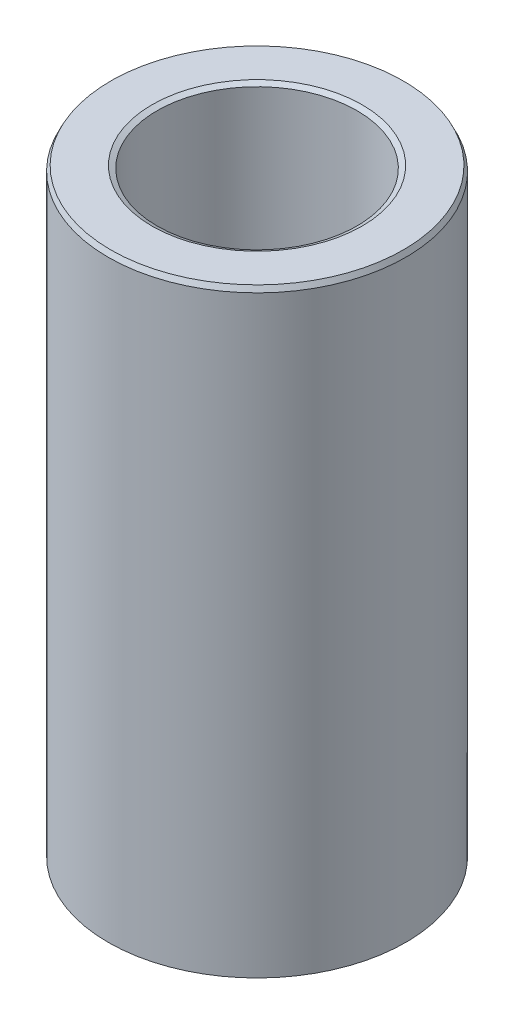
ISO-10303-21;
HEADER;
FILE_DESCRIPTION(('STEP AP214'),'2;1');
FILE_NAME('part.step','',(''),(''),'','','');
FILE_SCHEMA(('AUTOMOTIVE_DESIGN { 1 0 10303 214 1 1 1 1 }'));
ENDSEC;
DATA;
#1=APPLICATION_CONTEXT('core data for automotive mechanical design processes');
#2=APPLICATION_PROTOCOL_DEFINITION('international standard','automotive_design',2000,#1);
#3=PRODUCT_CONTEXT('',#1,'mechanical');
#4=PRODUCT('Part','Part','',(#3));
#5=PRODUCT_RELATED_PRODUCT_CATEGORY('part','',(#4));
#6=PRODUCT_DEFINITION_FORMATION('','',#4);
#7=PRODUCT_DEFINITION_CONTEXT('part definition',#1,'design');
#8=PRODUCT_DEFINITION('design','',#6,#7);
#9=PRODUCT_DEFINITION_SHAPE('','',#8);
#10=(LENGTH_UNIT() NAMED_UNIT(*) SI_UNIT(.MILLI.,.METRE.));
#11=(NAMED_UNIT(*) PLANE_ANGLE_UNIT() SI_UNIT($,.RADIAN.));
#12=(NAMED_UNIT(*) SI_UNIT($,.STERADIAN.) SOLID_ANGLE_UNIT());
#13=UNCERTAINTY_MEASURE_WITH_UNIT(LENGTH_MEASURE(1.E-05),#10,'distance_accuracy_value','');
#14=(GEOMETRIC_REPRESENTATION_CONTEXT(3) GLOBAL_UNCERTAINTY_ASSIGNED_CONTEXT((#13)) GLOBAL_UNIT_ASSIGNED_CONTEXT((#10,
#11,#12)) REPRESENTATION_CONTEXT('',''));
#15=CARTESIAN_POINT('',(0.,0.,0.));
#16=DIRECTION('',(0.,0.,1.));
#17=DIRECTION('',(1.,0.,0.));
#18=AXIS2_PLACEMENT_3D('',#15,#16,#17);
#19=CARTESIAN_POINT('',(0.,201.895542038575,0.));
#20=DIRECTION('',(0.,-1.,0.));
#21=DIRECTION('',(0.,0.,-1.));
#22=AXIS2_PLACEMENT_3D('',#19,#20,#21);
#23=CYLINDRICAL_SURFACE('',#22,50.);
#24=CARTESIAN_POINT('',(0.,0.842176969868269,0.));
#25=DIRECTION('',(0.,1.,0.));
#26=DIRECTION('',(0.,0.,1.));
#27=AXIS2_PLACEMENT_3D('',#24,#25,#26);
#28=CIRCLE('',#27,50.);
#29=CARTESIAN_POINT('',(0.,0.842176969868269,50.));
#30=VERTEX_POINT('',#29);
#31=EDGE_CURVE('E10',#30,#30,#28,.T.);
#32=ORIENTED_EDGE('',*,*,#31,.T.);
#33=EDGE_LOOP('',(#32));
#34=FACE_BOUND('',#33,.T.);
#35=CARTESIAN_POINT('',(0.,200.164972738618,0.));
#36=DIRECTION('',(0.,1.,0.));
#37=DIRECTION('',(0.,0.,1.));
#38=AXIS2_PLACEMENT_3D('',#35,#36,#37);
#39=CIRCLE('',#38,50.);
#40=CARTESIAN_POINT('',(0.,200.164972738618,50.));
#41=VERTEX_POINT('',#40);
#42=EDGE_CURVE('E50',#41,#41,#39,.F.);
#43=ORIENTED_EDGE('',*,*,#42,.T.);
#44=EDGE_LOOP('',(#43));
#45=FACE_BOUND('',#44,.T.);
#46=ADVANCED_FACE('F39',(#34,#45),#23,.T.);
#47=CARTESIAN_POINT('',(0.,201.895542038575,0.));
#48=DIRECTION('',(0.,1.,0.));
#49=DIRECTION('',(0.,0.,1.));
#50=AXIS2_PLACEMENT_3D('',#47,#48,#49);
#51=PLANE('',#50);
#52=CARTESIAN_POINT('',(0.,201.895542038575,0.));
#53=DIRECTION('',(0.,1.,0.));
#54=DIRECTION('',(0.,0.,1.));
#55=AXIS2_PLACEMENT_3D('',#52,#53,#54);
#56=CIRCLE('',#55,35.3079660368954);
#57=CARTESIAN_POINT('',(0.,201.895542038575,35.3079660368954));
#58=VERTEX_POINT('',#57);
#59=EDGE_CURVE('E58',#58,#58,#56,.F.);
#60=ORIENTED_EDGE('',*,*,#59,.T.);
#61=EDGE_LOOP('',(#60));
#62=FACE_BOUND('',#61,.T.);
#63=CARTESIAN_POINT('',(0.,201.895542038575,0.));
#64=DIRECTION('',(0.,1.,0.));
#65=DIRECTION('',(0.,0.,1.));
#66=AXIS2_PLACEMENT_3D('',#63,#64,#65);
#67=CIRCLE('',#66,49.1578230301318);
#68=CARTESIAN_POINT('',(0.,201.895542038575,49.1578230301318));
#69=VERTEX_POINT('',#68);
#70=EDGE_CURVE('E61',#69,#69,#67,.T.);
#71=ORIENTED_EDGE('',*,*,#70,.T.);
#72=EDGE_LOOP('',(#71));
#73=FACE_BOUND('',#72,.T.);
#74=ADVANCED_FACE('F88',(#62,#73),#51,.T.);
#75=CARTESIAN_POINT('',(0.,0.,0.));
#76=DIRECTION('',(0.,1.,0.));
#77=DIRECTION('',(0.,0.,1.));
#78=AXIS2_PLACEMENT_3D('',#75,#76,#77);
#79=PLANE('',#78);
#80=CARTESIAN_POINT('',(0.,0.,0.));
#81=DIRECTION('',(0.,1.,0.));
#82=DIRECTION('',(0.,0.,1.));
#83=AXIS2_PLACEMENT_3D('',#80,#81,#82);
#84=CIRCLE('',#83,34.4195737068063);
#85=CARTESIAN_POINT('',(0.,0.,34.4195737068063));
#86=VERTEX_POINT('',#85);
#87=EDGE_CURVE('E51',#86,#86,#84,.T.);
#88=ORIENTED_EDGE('',*,*,#87,.T.);
#89=EDGE_LOOP('',(#88));
#90=FACE_BOUND('',#89,.T.);
#91=CARTESIAN_POINT('',(0.,0.,0.));
#92=DIRECTION('',(0.,1.,0.));
#93=DIRECTION('',(0.,0.,1.));
#94=AXIS2_PLACEMENT_3D('',#91,#92,#93);
#95=CIRCLE('',#94,48.2694307000426);
#96=CARTESIAN_POINT('',(0.,0.,48.2694307000426));
#97=VERTEX_POINT('',#96);
#98=EDGE_CURVE('E54',#97,#97,#95,.F.);
#99=ORIENTED_EDGE('',*,*,#98,.T.);
#100=EDGE_LOOP('',(#99));
#101=FACE_BOUND('',#100,.T.);
#102=ADVANCED_FACE('F83',(#90,#101),#79,.F.);
#103=CARTESIAN_POINT('',(0.,201.895542038575,0.));
#104=DIRECTION('',(0.,-1.,0.));
#105=DIRECTION('',(0.,0.,-1.));
#106=AXIS2_PLACEMENT_3D('',#103,#104,#105);
#107=CYLINDRICAL_SURFACE('',#106,33.577396736938);
#108=CARTESIAN_POINT('',(0.,201.053365068707,0.));
#109=DIRECTION('',(0.,1.,0.));
#110=DIRECTION('',(0.,0.,1.));
#111=AXIS2_PLACEMENT_3D('',#108,#109,#110);
#112=CIRCLE('',#111,33.577396736938);
#113=CARTESIAN_POINT('',(0.,201.053365068707,33.5773967369379));
#114=VERTEX_POINT('',#113);
#115=EDGE_CURVE('E67',#114,#114,#112,.T.);
#116=ORIENTED_EDGE('',*,*,#115,.T.);
#117=EDGE_LOOP('',(#116));
#118=FACE_BOUND('',#117,.T.);
#119=CARTESIAN_POINT('',(0.,1.73056929995741,0.));
#120=DIRECTION('',(0.,1.,0.));
#121=DIRECTION('',(0.,0.,1.));
#122=AXIS2_PLACEMENT_3D('',#119,#120,#121);
#123=CIRCLE('',#122,33.577396736938);
#124=CARTESIAN_POINT('',(0.,1.73056929995741,33.577396736938));
#125=VERTEX_POINT('',#124);
#126=EDGE_CURVE('E69',#125,#125,#123,.F.);
#127=ORIENTED_EDGE('',*,*,#126,.T.);
#128=EDGE_LOOP('',(#127));
#129=FACE_BOUND('',#128,.T.);
#130=ADVANCED_FACE('F71',(#118,#129),#107,.F.);
#131=CARTESIAN_POINT('',(0.,201.053365068707,0.));
#132=DIRECTION('',(0.,1.,0.));
#133=DIRECTION('',(0.,0.,1.));
#134=AXIS2_PLACEMENT_3D('',#131,#132,#133);
#135=CONICAL_SURFACE('',#134,33.577396736938,1.11788778231858);
#136=CARTESIAN_POINT('',(0.,201.895542038575,35.3079660368954));
#137=CARTESIAN_POINT('',(0.,201.886769361806,35.2899392733542));
#138=CARTESIAN_POINT('',(0.,201.877996685036,35.2719125098129));
#139=CARTESIAN_POINT('',(0.,201.860451331498,35.2358589827305));
#140=CARTESIAN_POINT('',(0.,201.851678654728,35.2178322191893));
#141=CARTESIAN_POINT('',(0.,201.834133301189,35.1817786921068));
#142=CARTESIAN_POINT('',(0.,201.82536062442,35.1637519285656));
#143=CARTESIAN_POINT('',(0.,201.807815270881,35.1276984014832));
#144=CARTESIAN_POINT('',(0.,201.799042594111,35.1096716379419));
#145=CARTESIAN_POINT('',(0.,201.781497240572,35.0736181108595));
#146=CARTESIAN_POINT('',(0.,201.772724563803,35.0555913473183));
#147=CARTESIAN_POINT('',(0.,201.755179210264,35.0195378202358));
#148=CARTESIAN_POINT('',(0.,201.746406533495,35.0015110566946));
#149=CARTESIAN_POINT('',(0.,201.728861179956,34.9654575296122));
#150=CARTESIAN_POINT('',(0.,201.720088503186,34.9474307660709));
#151=CARTESIAN_POINT('',(0.,201.702543149647,34.9113772389885));
#152=CARTESIAN_POINT('',(0.,201.693770472878,34.8933504754473));
#153=CARTESIAN_POINT('',(0.,201.676225119339,34.8572969483648));
#154=CARTESIAN_POINT('',(0.,201.667452442569,34.8392701848236));
#155=CARTESIAN_POINT('',(0.,201.649907089031,34.8032166577411));
#156=CARTESIAN_POINT('',(0.,201.641134412261,34.7851898941999));
#157=CARTESIAN_POINT('',(0.,201.623589058722,34.7491363671175));
#158=CARTESIAN_POINT('',(0.,201.614816381953,34.7311096035763));
#159=CARTESIAN_POINT('',(0.,201.597271028414,34.6950560764938));
#160=CARTESIAN_POINT('',(0.,201.588498351644,34.6770293129526));
#161=CARTESIAN_POINT('',(0.,201.570952998105,34.6409757858701));
#162=CARTESIAN_POINT('',(0.,201.562180321336,34.6229490223289));
#163=CARTESIAN_POINT('',(0.,201.544634967797,34.5868954952465));
#164=CARTESIAN_POINT('',(0.,201.535862291028,34.5688687317052));
#165=CARTESIAN_POINT('',(0.,201.518316937489,34.5328152046228));
#166=CARTESIAN_POINT('',(0.,201.509544260719,34.5147884410816));
#167=CARTESIAN_POINT('',(0.,201.49199890718,34.4787349139991));
#168=CARTESIAN_POINT('',(0.,201.483226230411,34.4607081504579));
#169=CARTESIAN_POINT('',(0.,201.465680876872,34.4246546233754));
#170=CARTESIAN_POINT('',(0.,201.456908200102,34.4066278598342));
#171=CARTESIAN_POINT('',(0.,201.439362846563,34.3705743327518));
#172=CARTESIAN_POINT('',(0.,201.430590169794,34.3525475692106));
#173=CARTESIAN_POINT('',(0.,201.413044816255,34.3164940421281));
#174=CARTESIAN_POINT('',(0.,201.404272139486,34.2984672785869));
#175=CARTESIAN_POINT('',(0.,201.386726785947,34.2624137515044));
#176=CARTESIAN_POINT('',(0.,201.377954109177,34.2443869879632));
#177=CARTESIAN_POINT('',(0.,201.360408755638,34.2083334608808));
#178=CARTESIAN_POINT('',(0.,201.351636078869,34.1903066973395));
#179=CARTESIAN_POINT('',(0.,201.33409072533,34.1542531702571));
#180=CARTESIAN_POINT('',(0.,201.32531804856,34.1362264067159));
#181=CARTESIAN_POINT('',(0.,201.307772695021,34.1001728796334));
#182=CARTESIAN_POINT('',(0.,201.299000018252,34.0821461160922));
#183=CARTESIAN_POINT('',(0.,201.281454664713,34.0460925890098));
#184=CARTESIAN_POINT('',(0.,201.272681987944,34.0280658254685));
#185=CARTESIAN_POINT('',(0.,201.255136634405,33.9920122983861));
#186=CARTESIAN_POINT('',(0.,201.246363957635,33.9739855348449));
#187=CARTESIAN_POINT('',(0.,201.228818604096,33.9379320077624));
#188=CARTESIAN_POINT('',(0.,201.220045927327,33.9199052442212));
#189=CARTESIAN_POINT('',(0.,201.202500573788,33.8838517171387));
#190=CARTESIAN_POINT('',(0.,201.193727897019,33.8658249535975));
#191=CARTESIAN_POINT('',(0.,201.17618254348,33.8297714265151));
#192=CARTESIAN_POINT('',(0.,201.16740986671,33.8117446629739));
#193=CARTESIAN_POINT('',(0.,201.149864513171,33.7756911358914));
#194=CARTESIAN_POINT('',(0.,201.141091836402,33.7576643723502));
#195=CARTESIAN_POINT('',(0.,201.123546482863,33.7216108452677));
#196=CARTESIAN_POINT('',(0.,201.114773806093,33.7035840817265));
#197=CARTESIAN_POINT('',(0.,201.097228452554,33.6675305546441));
#198=CARTESIAN_POINT('',(0.,201.088455775785,33.6495037911028));
#199=CARTESIAN_POINT('',(0.,201.070910422246,33.6134502640204));
#200=CARTESIAN_POINT('',(0.,201.062137745477,33.5954235004792));
#201=CARTESIAN_POINT('',(0.,201.053365068707,33.5773967369379));
#202=B_SPLINE_CURVE_WITH_KNOTS('',3,(#136,#137,#138,#139,#140,#141,#142,#143,#144,#145,#146,
#147,#148,#149,#150,#151,#152,#153,#154,#155,#156,#157,#158,#159,#160,#161,#162,#163,#164,#165,
#166,#167,#168,#169,#170,#171,#172,#173,#174,#175,#176,#177,#178,#179,#180,#181,#182,#183,#184,
#185,#186,#187,#188,#189,#190,#191,#192,#193,#194,#195,#196,#197,#198,#199,#200,#201),
.UNSPECIFIED.,.F.,.F.,(4,2,2,2,2,2,2,2,2,2,2,2,2,2,2,2,2,2,2,2,2,2,2,2,2,2,2,2,2,2,2,2,4),(0.,
0.0601441314947181,0.120288262989436,0.180432394484161,0.240576525978867,0.300720657473585,
0.360864788968303,0.421008920463009,0.481153051957733,0.541297183452451,0.601441314947157,
0.661585446441875,0.721729577936593,0.781873709431306,0.842017840926024,0.902161972420742,
0.962306103915448,1.02245023541017,1.08259436690488,1.14273849839961,1.20288262989431,
1.26302676138903,1.32317089288375,1.38331502437846,1.44345915587318,1.5036032873679,
1.56374741886261,1.62389155035732,1.68403568185204,1.74417981334675,1.80432394484147,
1.86446807633619,1.9246122078309),.UNSPECIFIED.);
#203=EDGE_CURVE('BSEAM77',#58,#114,#202,.T.);
#204=ORIENTED_EDGE('',*,*,#59,.F.);
#205=ORIENTED_EDGE('',*,*,#115,.F.);
#206=ORIENTED_EDGE('',*,*,#203,.T.);
#207=ORIENTED_EDGE('',*,*,#203,.F.);
#208=EDGE_LOOP('',(#204,#206,#205,#207));
#209=FACE_BOUND('',#208,.T.);
#210=ADVANCED_FACE('F77',(#209),#135,.F.);
#211=CARTESIAN_POINT('',(0.,0.,0.));
#212=DIRECTION('',(0.,-1.,0.));
#213=DIRECTION('',(0.,0.,-1.));
#214=AXIS2_PLACEMENT_3D('',#211,#212,#213);
#215=CONICAL_SURFACE('',#214,34.4195737068063,0.452908544476328);
#216=ORIENTED_EDGE('',*,*,#126,.F.);
#217=EDGE_LOOP('',(#216));
#218=FACE_BOUND('',#217,.T.);
#219=ORIENTED_EDGE('',*,*,#87,.F.);
#220=EDGE_LOOP('',(#219));
#221=FACE_BOUND('',#220,.T.);
#222=ADVANCED_FACE('F73',(#218,#221),#215,.F.);
#223=CARTESIAN_POINT('',(0.,0.842176969868269,0.));
#224=DIRECTION('',(0.,1.,0.));
#225=DIRECTION('',(0.,0.,1.));
#226=AXIS2_PLACEMENT_3D('',#223,#224,#225);
#227=CONICAL_SURFACE('',#226,50.,1.11788778231857);
#228=CARTESIAN_POINT('',(0.,0.,48.2694307000426));
#229=CARTESIAN_POINT('',(0.,0.00877267676946104,48.2874574635838));
#230=CARTESIAN_POINT('',(0.,0.0175453535389222,48.3054842271251));
#231=CARTESIAN_POINT('',(0.,0.0350907070778444,48.3415377542075));
#232=CARTESIAN_POINT('',(0.,0.0438633838473056,48.3595645177487));
#233=CARTESIAN_POINT('',(0.,0.0614087373862278,48.3956180448312));
#234=CARTESIAN_POINT('',(0.,0.070181414155689,48.4136448083724));
#235=CARTESIAN_POINT('',(0.,0.0877267676946112,48.4496983354548));
#236=CARTESIAN_POINT('',(0.,0.0964994444640723,48.4677250989961));
#237=CARTESIAN_POINT('',(0.,0.114044798002995,48.5037786260785));
#238=CARTESIAN_POINT('',(0.,0.122817474772456,48.5218053896197));
#239=CARTESIAN_POINT('',(0.,0.140362828311378,48.5578589167022));
#240=CARTESIAN_POINT('',(0.,0.149135505080839,48.5758856802434));
#241=CARTESIAN_POINT('',(0.,0.166680858619761,48.6119392073258));
#242=CARTESIAN_POINT('',(0.,0.175453535389223,48.6299659708671));
#243=CARTESIAN_POINT('',(0.,0.192998888928145,48.6660194979495));
#244=CARTESIAN_POINT('',(0.,0.201771565697606,48.6840462614907));
#245=CARTESIAN_POINT('',(0.,0.219316919236528,48.7200997885732));
#246=CARTESIAN_POINT('',(0.,0.228089596005989,48.7381265521144));
#247=CARTESIAN_POINT('',(0.,0.245634949544912,48.7741800791968));
#248=CARTESIAN_POINT('',(0.,0.254407626314373,48.7922068427381));
#249=CARTESIAN_POINT('',(0.,0.271952979853295,48.8282603698205));
#250=CARTESIAN_POINT('',(0.,0.280725656622756,48.8462871333617));
#251=CARTESIAN_POINT('',(0.,0.298271010161679,48.8823406604442));
#252=CARTESIAN_POINT('',(0.,0.30704368693114,48.9003674239854));
#253=CARTESIAN_POINT('',(0.,0.324589040470062,48.9364209510679));
#254=CARTESIAN_POINT('',(0.,0.333361717239523,48.9544477146091));
#255=CARTESIAN_POINT('',(0.,0.350907070778445,48.9905012416915));
#256=CARTESIAN_POINT('',(0.,0.359679747547906,49.0085280052327));
#257=CARTESIAN_POINT('',(0.,0.377225101086829,49.0445815323152));
#258=CARTESIAN_POINT('',(0.,0.38599777785629,49.0626082958564));
#259=CARTESIAN_POINT('',(0.,0.403543131395212,49.0986618229389));
#260=CARTESIAN_POINT('',(0.,0.412315808164673,49.1166885864801));
#261=CARTESIAN_POINT('',(0.,0.429861161703596,49.1527421135625));
#262=CARTESIAN_POINT('',(0.,0.438633838473057,49.1707688771038));
#263=CARTESIAN_POINT('',(0.,0.456179192011979,49.2068224041862));
#264=CARTESIAN_POINT('',(0.,0.46495186878144,49.2248491677274));
#265=CARTESIAN_POINT('',(0.,0.482497222320362,49.2609026948099));
#266=CARTESIAN_POINT('',(0.,0.491269899089824,49.2789294583511));
#267=CARTESIAN_POINT('',(0.,0.508815252628746,49.3149829854335));
#268=CARTESIAN_POINT('',(0.,0.517587929398207,49.3330097489748));
#269=CARTESIAN_POINT('',(0.,0.535133282937129,49.3690632760572));
#270=CARTESIAN_POINT('',(0.,0.54390595970659,49.3870900395984));
#271=CARTESIAN_POINT('',(0.,0.561451313245513,49.4231435666809));
#272=CARTESIAN_POINT('',(0.,0.570223990014974,49.4411703302221));
#273=CARTESIAN_POINT('',(0.,0.587769343553896,49.4772238573045));
#274=CARTESIAN_POINT('',(0.,0.596542020323357,49.4952506208458));
#275=CARTESIAN_POINT('',(0.,0.614087373862279,49.5313041479282));
#276=CARTESIAN_POINT('',(0.,0.622860050631741,49.5493309114694));
#277=CARTESIAN_POINT('',(0.,0.640405404170663,49.5853844385519));
#278=CARTESIAN_POINT('',(0.,0.649178080940124,49.6034112020931));
#279=CARTESIAN_POINT('',(0.,0.666723434479046,49.6394647291755));
#280=CARTESIAN_POINT('',(0.,0.675496111248507,49.6574914927168));
#281=CARTESIAN_POINT('',(0.,0.69304146478743,49.6935450197992));
#282=CARTESIAN_POINT('',(0.,0.701814141556891,49.7115717833404));
#283=CARTESIAN_POINT('',(0.,0.719359495095813,49.7476253104229));
#284=CARTESIAN_POINT('',(0.,0.728132171865274,49.7656520739641));
#285=CARTESIAN_POINT('',(0.,0.745677525404196,49.8017056010465));
#286=CARTESIAN_POINT('',(0.,0.754450202173658,49.8197323645878));
#287=CARTESIAN_POINT('',(0.,0.77199555571258,49.8557858916702));
#288=CARTESIAN_POINT('',(0.,0.780768232482041,49.8738126552114));
#289=CARTESIAN_POINT('',(0.,0.798313586020963,49.9098661822939));
#290=CARTESIAN_POINT('',(0.,0.807086262790425,49.9278929458351));
#291=CARTESIAN_POINT('',(0.,0.824631616329347,49.9639464729176));
#292=CARTESIAN_POINT('',(0.,0.833404293098808,49.9819732364588));
#293=CARTESIAN_POINT('',(0.,0.842176969868269,50.));
#294=B_SPLINE_CURVE_WITH_KNOTS('',3,(#228,#229,#230,#231,#232,#233,#234,#235,#236,#237,#238,
#239,#240,#241,#242,#243,#244,#245,#246,#247,#248,#249,#250,#251,#252,#253,#254,#255,#256,#257,
#258,#259,#260,#261,#262,#263,#264,#265,#266,#267,#268,#269,#270,#271,#272,#273,#274,#275,#276,
#277,#278,#279,#280,#281,#282,#283,#284,#285,#286,#287,#288,#289,#290,#291,#292,#293),
.UNSPECIFIED.,.F.,.F.,(4,2,2,2,2,2,2,2,2,2,2,2,2,2,2,2,2,2,2,2,2,2,2,2,2,2,2,2,2,2,2,2,4),(0.,
0.0601441314947143,0.120288262989429,0.180432394484143,0.240576525978857,0.300720657473572,
0.360864788968286,0.421008920462994,0.481153051957708,0.541297183452423,0.601441314947137,
0.661585446441851,0.721729577936566,0.78187370943128,0.842017840925994,0.902161972420709,
0.962306103915423,1.02245023541014,1.08259436690485,1.14273849839957,1.20288262989428,
1.26302676138899,1.32317089288371,1.38331502437842,1.44345915587313,1.50360328736785,
1.56374741886256,1.62389155035727,1.68403568185199,1.7441798133467,1.80432394484142,
1.86446807633613,1.92461220783085),.UNSPECIFIED.);
#295=EDGE_CURVE('BSEAM76',#97,#30,#294,.T.);
#296=ORIENTED_EDGE('',*,*,#98,.F.);
#297=ORIENTED_EDGE('',*,*,#31,.F.);
#298=ORIENTED_EDGE('',*,*,#295,.T.);
#299=ORIENTED_EDGE('',*,*,#295,.F.);
#300=EDGE_LOOP('',(#296,#298,#297,#299));
#301=FACE_BOUND('',#300,.T.);
#302=ADVANCED_FACE('F76',(#301),#227,.T.);
#303=CARTESIAN_POINT('',(0.,201.895542038575,0.));
#304=DIRECTION('',(0.,-1.,0.));
#305=DIRECTION('',(0.,0.,-1.));
#306=AXIS2_PLACEMENT_3D('',#303,#304,#305);
#307=CONICAL_SURFACE('',#306,49.1578230301318,0.452908544476315);
#308=ORIENTED_EDGE('',*,*,#42,.F.);
#309=EDGE_LOOP('',(#308));
#310=FACE_BOUND('',#309,.T.);
#311=ORIENTED_EDGE('',*,*,#70,.F.);
#312=EDGE_LOOP('',(#311));
#313=FACE_BOUND('',#312,.T.);
#314=ADVANCED_FACE('F45',(#310,#313),#307,.T.);
#315=CLOSED_SHELL('',(#46,#74,#102,#130,#210,#222,#302,#314));
#316=MANIFOLD_SOLID_BREP('B2',#315);
#317=ADVANCED_BREP_SHAPE_REPRESENTATION('',(#18,#316),#14);
#318=SHAPE_DEFINITION_REPRESENTATION(#9,#317);
ENDSEC;
END-ISO-10303-21;
